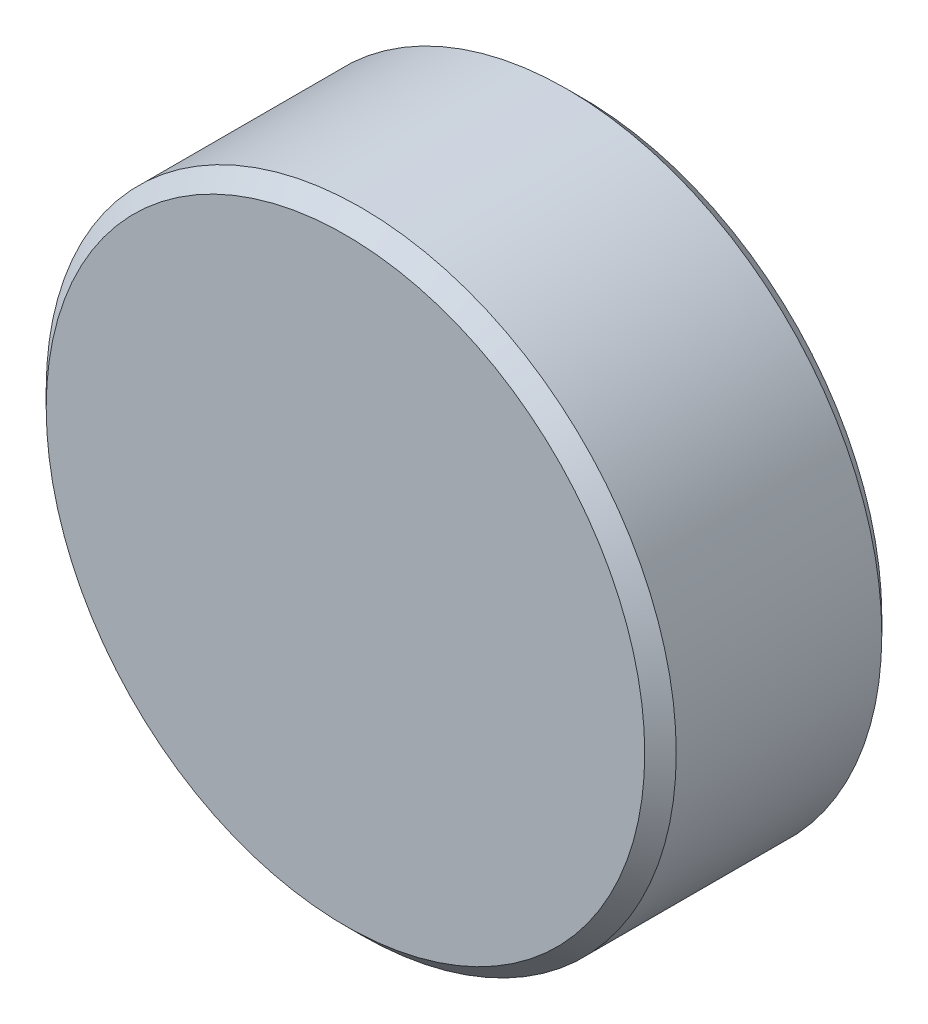
ISO-10303-21;
HEADER;
FILE_DESCRIPTION(('STEP AP214'),'2;1');
FILE_NAME('part.step','',(''),(''),'','','');
FILE_SCHEMA(('AUTOMOTIVE_DESIGN { 1 0 10303 214 1 1 1 1 }'));
ENDSEC;
DATA;
#1=APPLICATION_CONTEXT('core data for automotive mechanical design processes');
#2=APPLICATION_PROTOCOL_DEFINITION('international standard','automotive_design',2000,#1);
#3=PRODUCT_CONTEXT('',#1,'mechanical');
#4=PRODUCT('Part','Part','',(#3));
#5=PRODUCT_RELATED_PRODUCT_CATEGORY('part','',(#4));
#6=PRODUCT_DEFINITION_FORMATION('','',#4);
#7=PRODUCT_DEFINITION_CONTEXT('part definition',#1,'design');
#8=PRODUCT_DEFINITION('design','',#6,#7);
#9=PRODUCT_DEFINITION_SHAPE('','',#8);
#10=(LENGTH_UNIT() NAMED_UNIT(*) SI_UNIT(.MILLI.,.METRE.));
#11=(NAMED_UNIT(*) PLANE_ANGLE_UNIT() SI_UNIT($,.RADIAN.));
#12=(NAMED_UNIT(*) SI_UNIT($,.STERADIAN.) SOLID_ANGLE_UNIT());
#13=UNCERTAINTY_MEASURE_WITH_UNIT(LENGTH_MEASURE(1.E-05),#10,'distance_accuracy_value','');
#14=(GEOMETRIC_REPRESENTATION_CONTEXT(3) GLOBAL_UNCERTAINTY_ASSIGNED_CONTEXT((#13)) GLOBAL_UNIT_ASSIGNED_CONTEXT((#10,
#11,#12)) REPRESENTATION_CONTEXT('',''));
#15=CARTESIAN_POINT('',(0.,0.,0.));
#16=DIRECTION('',(0.,0.,1.));
#17=DIRECTION('',(1.,0.,0.));
#18=AXIS2_PLACEMENT_3D('',#15,#16,#17);
#19=CARTESIAN_POINT('',(0.,-11.75,495.175));
#20=DIRECTION('',(0.,0.,-1.));
#21=DIRECTION('',(0.,-1.,0.));
#22=AXIS2_PLACEMENT_3D('',#19,#20,#21);
#23=PLANE('',#22);
#24=CARTESIAN_POINT('',(0.,-11.75,495.175));
#25=DIRECTION('',(0.,0.,1.));
#26=DIRECTION('',(1.,0.,0.));
#27=AXIS2_PLACEMENT_3D('',#24,#25,#26);
#28=CIRCLE('',#27,38.);
#29=CARTESIAN_POINT('',(38.,-11.75,495.175));
#30=VERTEX_POINT('',#29);
#31=EDGE_CURVE('E56',#30,#30,#28,.T.);
#32=ORIENTED_EDGE('',*,*,#31,.T.);
#33=EDGE_LOOP('',(#32));
#34=FACE_BOUND('',#33,.T.);
#35=ADVANCED_FACE('F17',(#34),#23,.F.);
#36=CARTESIAN_POINT('',(0.,-11.75,465.075));
#37=DIRECTION('',(0.,0.,-1.));
#38=DIRECTION('',(0.,-1.,0.));
#39=AXIS2_PLACEMENT_3D('',#36,#37,#38);
#40=PLANE('',#39);
#41=CARTESIAN_POINT('',(0.,-11.75,465.075));
#42=DIRECTION('',(0.,0.,-1.));
#43=DIRECTION('',(1.,0.,0.));
#44=AXIS2_PLACEMENT_3D('',#41,#42,#43);
#45=CIRCLE('',#44,38.);
#46=CARTESIAN_POINT('',(-38.,-11.75,465.075));
#47=VERTEX_POINT('',#46);
#48=EDGE_CURVE('E27',#47,#47,#45,.T.);
#49=ORIENTED_EDGE('',*,*,#48,.T.);
#50=EDGE_LOOP('',(#49));
#51=FACE_BOUND('',#50,.T.);
#52=ADVANCED_FACE('F94',(#51),#40,.T.);
#53=CARTESIAN_POINT('',(0.,-11.75,465.075));
#54=DIRECTION('',(0.,0.,1.));
#55=DIRECTION('',(-1.,0.,0.));
#56=AXIS2_PLACEMENT_3D('',#53,#54,#55);
#57=CYLINDRICAL_SURFACE('',#56,40.);
#58=CARTESIAN_POINT('',(0.,-11.75,493.175));
#59=DIRECTION('',(0.,0.,-1.));
#60=DIRECTION('',(1.,0.,0.));
#61=AXIS2_PLACEMENT_3D('',#58,#59,#60);
#62=CIRCLE('',#61,40.);
#63=CARTESIAN_POINT('',(40.,-11.75,493.175));
#64=VERTEX_POINT('',#63);
#65=EDGE_CURVE('E21',#64,#64,#62,.T.);
#66=ORIENTED_EDGE('',*,*,#65,.T.);
#67=EDGE_LOOP('',(#66));
#68=FACE_BOUND('',#67,.T.);
#69=CARTESIAN_POINT('',(0.,-11.75,467.075));
#70=DIRECTION('',(0.,0.,1.));
#71=DIRECTION('',(1.,0.,0.));
#72=AXIS2_PLACEMENT_3D('',#69,#70,#71);
#73=CIRCLE('',#72,40.);
#74=CARTESIAN_POINT('',(-40.,-11.75,467.075));
#75=VERTEX_POINT('',#74);
#76=EDGE_CURVE('E11',#75,#75,#73,.T.);
#77=ORIENTED_EDGE('',*,*,#76,.T.);
#78=EDGE_LOOP('',(#77));
#79=FACE_BOUND('',#78,.T.);
#80=ADVANCED_FACE('F85',(#68,#79),#57,.T.);
#81=CARTESIAN_POINT('',(0.,-11.75,465.075));
#82=DIRECTION('',(0.,0.,1.));
#83=DIRECTION('',(-1.,0.,0.));
#84=AXIS2_PLACEMENT_3D('',#81,#82,#83);
#85=CONICAL_SURFACE('',#84,38.,0.785398163397448);
#86=ORIENTED_EDGE('',*,*,#76,.F.);
#87=EDGE_LOOP('',(#86));
#88=FACE_BOUND('',#87,.T.);
#89=ORIENTED_EDGE('',*,*,#48,.F.);
#90=EDGE_LOOP('',(#89));
#91=FACE_BOUND('',#90,.T.);
#92=ADVANCED_FACE('F81',(#88,#91),#85,.T.);
#93=CARTESIAN_POINT('',(0.,-11.75,493.175));
#94=DIRECTION('',(0.,0.,-1.));
#95=DIRECTION('',(1.,0.,0.));
#96=AXIS2_PLACEMENT_3D('',#93,#94,#95);
#97=CONICAL_SURFACE('',#96,40.,0.785398163397448);
#98=ORIENTED_EDGE('',*,*,#65,.F.);
#99=EDGE_LOOP('',(#98));
#100=FACE_BOUND('',#99,.T.);
#101=ORIENTED_EDGE('',*,*,#31,.F.);
#102=EDGE_LOOP('',(#101));
#103=FACE_BOUND('',#102,.T.);
#104=ADVANCED_FACE('F19',(#100,#103),#97,.T.);
#105=CLOSED_SHELL('',(#35,#52,#80,#92,#104));
#106=MANIFOLD_SOLID_BREP('B1',#105);
#107=ADVANCED_BREP_SHAPE_REPRESENTATION('',(#18,#106),#14);
#108=SHAPE_DEFINITION_REPRESENTATION(#9,#107);
ENDSEC;
END-ISO-10303-21;
